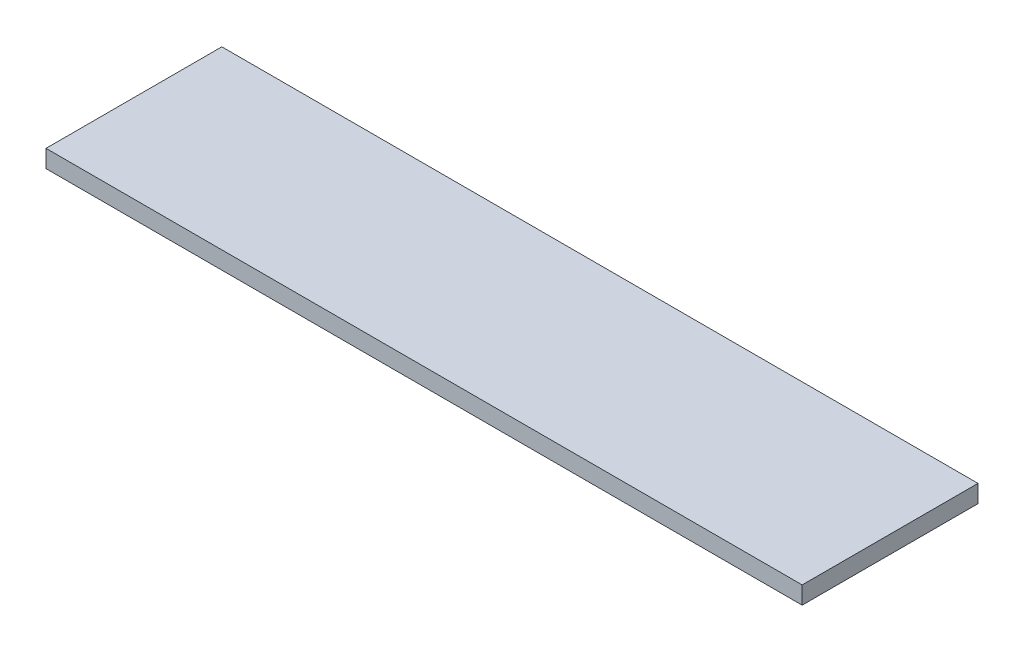
ISO-10303-21;
HEADER;
FILE_DESCRIPTION(('STEP AP214'),'2;1');
FILE_NAME('part.step','',(''),(''),'','','');
FILE_SCHEMA(('AUTOMOTIVE_DESIGN { 1 0 10303 214 1 1 1 1 }'));
ENDSEC;
DATA;
#1=APPLICATION_CONTEXT('core data for automotive mechanical design processes');
#2=APPLICATION_PROTOCOL_DEFINITION('international standard','automotive_design',2000,#1);
#3=PRODUCT_CONTEXT('',#1,'mechanical');
#4=PRODUCT('Part','Part','',(#3));
#5=PRODUCT_RELATED_PRODUCT_CATEGORY('part','',(#4));
#6=PRODUCT_DEFINITION_FORMATION('','',#4);
#7=PRODUCT_DEFINITION_CONTEXT('part definition',#1,'design');
#8=PRODUCT_DEFINITION('design','',#6,#7);
#9=PRODUCT_DEFINITION_SHAPE('','',#8);
#10=(LENGTH_UNIT() NAMED_UNIT(*) SI_UNIT(.MILLI.,.METRE.));
#11=(NAMED_UNIT(*) PLANE_ANGLE_UNIT() SI_UNIT($,.RADIAN.));
#12=(NAMED_UNIT(*) SI_UNIT($,.STERADIAN.) SOLID_ANGLE_UNIT());
#13=UNCERTAINTY_MEASURE_WITH_UNIT(LENGTH_MEASURE(1.E-05),#10,'distance_accuracy_value','');
#14=(GEOMETRIC_REPRESENTATION_CONTEXT(3) GLOBAL_UNCERTAINTY_ASSIGNED_CONTEXT((#13)) GLOBAL_UNIT_ASSIGNED_CONTEXT((#10,
#11,#12)) REPRESENTATION_CONTEXT('',''));
#15=CARTESIAN_POINT('',(0.,0.,0.));
#16=DIRECTION('',(0.,0.,1.));
#17=DIRECTION('',(1.,0.,0.));
#18=AXIS2_PLACEMENT_3D('',#15,#16,#17);
#19=CARTESIAN_POINT('',(-215.,10.,-50.));
#20=DIRECTION('',(1.,0.,0.));
#21=DIRECTION('',(0.,0.,-1.));
#22=AXIS2_PLACEMENT_3D('',#19,#20,#21);
#23=PLANE('',#22);
#24=DIRECTION('',(0.,0.,1.));
#25=VECTOR('',#24,1.);
#26=CARTESIAN_POINT('',(-215.,0.,-50.));
#27=LINE('',#26,#25);
#28=CARTESIAN_POINT('',(-215.,0.,-50.));
#29=VERTEX_POINT('',#28);
#30=CARTESIAN_POINT('',(-215.,0.,50.));
#31=VERTEX_POINT('',#30);
#32=EDGE_CURVE('E96',#29,#31,#27,.T.);
#33=ORIENTED_EDGE('',*,*,#32,.T.);
#34=DIRECTION('',(0.,-1.,0.));
#35=VECTOR('',#34,1.);
#36=CARTESIAN_POINT('',(-215.,10.,50.));
#37=LINE('',#36,#35);
#38=CARTESIAN_POINT('',(-215.,10.,50.));
#39=VERTEX_POINT('',#38);
#40=EDGE_CURVE('E11',#39,#31,#37,.T.);
#41=ORIENTED_EDGE('',*,*,#40,.F.);
#42=DIRECTION('',(0.,0.,1.));
#43=VECTOR('',#42,1.);
#44=CARTESIAN_POINT('',(-215.,10.,-50.));
#45=LINE('',#44,#43);
#46=CARTESIAN_POINT('',(-215.,10.,-50.));
#47=VERTEX_POINT('',#46);
#48=EDGE_CURVE('E84',#47,#39,#45,.T.);
#49=ORIENTED_EDGE('',*,*,#48,.F.);
#50=DIRECTION('',(0.,-1.,0.));
#51=VECTOR('',#50,1.);
#52=CARTESIAN_POINT('',(-215.,10.,-50.));
#53=LINE('',#52,#51);
#54=EDGE_CURVE('E92',#47,#29,#53,.T.);
#55=ORIENTED_EDGE('',*,*,#54,.T.);
#56=EDGE_LOOP('',(#33,#41,#49,#55));
#57=FACE_BOUND('',#56,.T.);
#58=ADVANCED_FACE('F33',(#57),#23,.F.);
#59=CARTESIAN_POINT('',(-215.,10.,50.));
#60=DIRECTION('',(0.,0.,-1.));
#61=DIRECTION('',(-1.,0.,0.));
#62=AXIS2_PLACEMENT_3D('',#59,#60,#61);
#63=PLANE('',#62);
#64=DIRECTION('',(1.,0.,0.));
#65=VECTOR('',#64,1.);
#66=CARTESIAN_POINT('',(-215.,0.,50.));
#67=LINE('',#66,#65);
#68=CARTESIAN_POINT('',(215.,0.,50.));
#69=VERTEX_POINT('',#68);
#70=EDGE_CURVE('E88',#31,#69,#67,.T.);
#71=ORIENTED_EDGE('',*,*,#70,.T.);
#72=DIRECTION('',(0.,-1.,0.));
#73=VECTOR('',#72,1.);
#74=CARTESIAN_POINT('',(215.,10.,50.));
#75=LINE('',#74,#73);
#76=CARTESIAN_POINT('',(215.,10.,50.));
#77=VERTEX_POINT('',#76);
#78=EDGE_CURVE('E41',#77,#69,#75,.T.);
#79=ORIENTED_EDGE('',*,*,#78,.F.);
#80=DIRECTION('',(1.,0.,0.));
#81=VECTOR('',#80,1.);
#82=CARTESIAN_POINT('',(-215.,10.,50.));
#83=LINE('',#82,#81);
#84=EDGE_CURVE('E79',#39,#77,#83,.T.);
#85=ORIENTED_EDGE('',*,*,#84,.F.);
#86=ORIENTED_EDGE('',*,*,#40,.T.);
#87=EDGE_LOOP('',(#71,#79,#85,#86));
#88=FACE_BOUND('',#87,.T.);
#89=ADVANCED_FACE('F87',(#88),#63,.F.);
#90=CARTESIAN_POINT('',(215.,10.,-50.));
#91=DIRECTION('',(-1.,0.,0.));
#92=DIRECTION('',(0.,0.,1.));
#93=AXIS2_PLACEMENT_3D('',#90,#91,#92);
#94=PLANE('',#93);
#95=DIRECTION('',(0.,0.,-1.));
#96=VECTOR('',#95,1.);
#97=CARTESIAN_POINT('',(215.,0.,-50.));
#98=LINE('',#97,#96);
#99=CARTESIAN_POINT('',(215.,0.,-50.));
#100=VERTEX_POINT('',#99);
#101=EDGE_CURVE('E66',#69,#100,#98,.T.);
#102=ORIENTED_EDGE('',*,*,#101,.T.);
#103=DIRECTION('',(0.,-1.,0.));
#104=VECTOR('',#103,1.);
#105=CARTESIAN_POINT('',(215.,10.,-50.));
#106=LINE('',#105,#104);
#107=CARTESIAN_POINT('',(215.,10.,-50.));
#108=VERTEX_POINT('',#107);
#109=EDGE_CURVE('E89',#108,#100,#106,.T.);
#110=ORIENTED_EDGE('',*,*,#109,.F.);
#111=DIRECTION('',(0.,0.,-1.));
#112=VECTOR('',#111,1.);
#113=CARTESIAN_POINT('',(215.,10.,-50.));
#114=LINE('',#113,#112);
#115=EDGE_CURVE('E82',#77,#108,#114,.T.);
#116=ORIENTED_EDGE('',*,*,#115,.F.);
#117=ORIENTED_EDGE('',*,*,#78,.T.);
#118=EDGE_LOOP('',(#102,#110,#116,#117));
#119=FACE_BOUND('',#118,.T.);
#120=ADVANCED_FACE('F90',(#119),#94,.F.);
#121=CARTESIAN_POINT('',(-215.,10.,-50.));
#122=DIRECTION('',(0.,0.,1.));
#123=DIRECTION('',(1.,0.,0.));
#124=AXIS2_PLACEMENT_3D('',#121,#122,#123);
#125=PLANE('',#124);
#126=DIRECTION('',(-1.,0.,0.));
#127=VECTOR('',#126,1.);
#128=CARTESIAN_POINT('',(-215.,0.,-50.));
#129=LINE('',#128,#127);
#130=EDGE_CURVE('E72',#100,#29,#129,.T.);
#131=ORIENTED_EDGE('',*,*,#130,.T.);
#132=ORIENTED_EDGE('',*,*,#54,.F.);
#133=DIRECTION('',(-1.,0.,0.));
#134=VECTOR('',#133,1.);
#135=CARTESIAN_POINT('',(-215.,10.,-50.));
#136=LINE('',#135,#134);
#137=EDGE_CURVE('E49',#108,#47,#136,.T.);
#138=ORIENTED_EDGE('',*,*,#137,.F.);
#139=ORIENTED_EDGE('',*,*,#109,.T.);
#140=EDGE_LOOP('',(#131,#132,#138,#139));
#141=FACE_BOUND('',#140,.T.);
#142=ADVANCED_FACE('F103',(#141),#125,.F.);
#143=CARTESIAN_POINT('',(0.,10.,0.));
#144=DIRECTION('',(0.,1.,0.));
#145=DIRECTION('',(0.,0.,1.));
#146=AXIS2_PLACEMENT_3D('',#143,#144,#145);
#147=PLANE('',#146);
#148=ORIENTED_EDGE('',*,*,#48,.T.);
#149=ORIENTED_EDGE('',*,*,#84,.T.);
#150=ORIENTED_EDGE('',*,*,#115,.T.);
#151=ORIENTED_EDGE('',*,*,#137,.T.);
#152=EDGE_LOOP('',(#148,#149,#150,#151));
#153=FACE_BOUND('',#152,.T.);
#154=ADVANCED_FACE('F80',(#153),#147,.T.);
#155=CARTESIAN_POINT('',(0.,0.,0.));
#156=DIRECTION('',(0.,1.,0.));
#157=DIRECTION('',(0.,0.,1.));
#158=AXIS2_PLACEMENT_3D('',#155,#156,#157);
#159=PLANE('',#158);
#160=ORIENTED_EDGE('',*,*,#32,.F.);
#161=ORIENTED_EDGE('',*,*,#130,.F.);
#162=ORIENTED_EDGE('',*,*,#101,.F.);
#163=ORIENTED_EDGE('',*,*,#70,.F.);
#164=EDGE_LOOP('',(#160,#161,#162,#163));
#165=FACE_BOUND('',#164,.T.);
#166=ADVANCED_FACE('F106',(#165),#159,.F.);
#167=CLOSED_SHELL('',(#58,#89,#120,#142,#154,#166));
#168=MANIFOLD_SOLID_BREP('B2',#167);
#169=ADVANCED_BREP_SHAPE_REPRESENTATION('',(#18,#168),#14);
#170=SHAPE_DEFINITION_REPRESENTATION(#9,#169);
ENDSEC;
END-ISO-10303-21;
